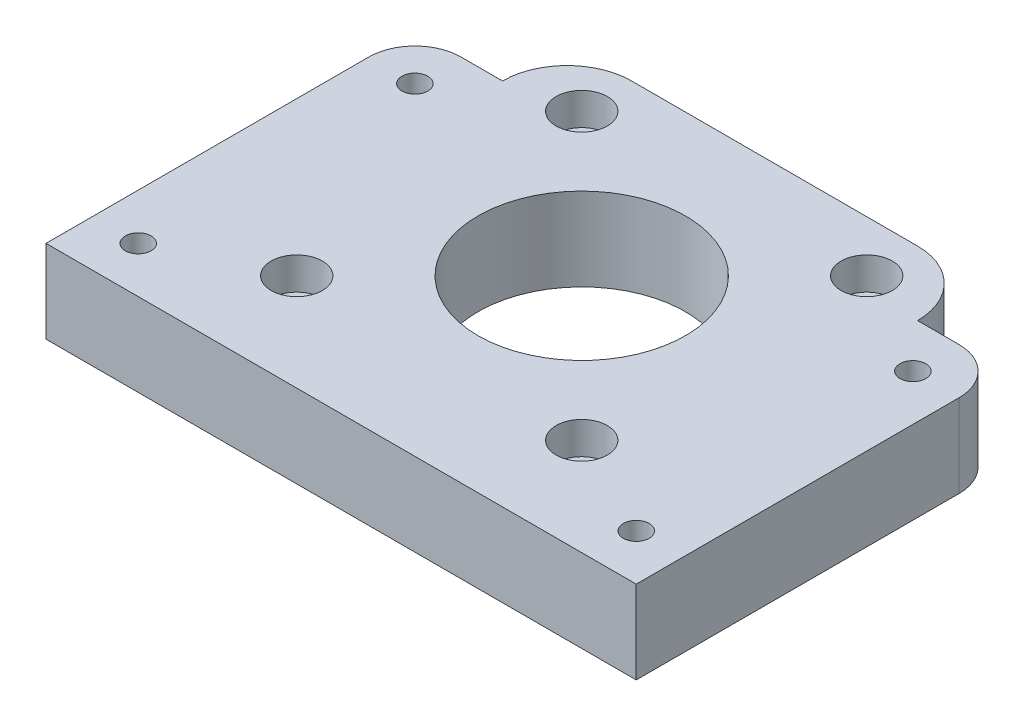
ISO-10303-21;
HEADER;
FILE_DESCRIPTION(('STEP AP214'),'2;1');
FILE_NAME('part.step','',(''),(''),'','','');
FILE_SCHEMA(('AUTOMOTIVE_DESIGN { 1 0 10303 214 1 1 1 1 }'));
ENDSEC;
DATA;
#1=APPLICATION_CONTEXT('core data for automotive mechanical design processes');
#2=APPLICATION_PROTOCOL_DEFINITION('international standard','automotive_design',2000,#1);
#3=PRODUCT_CONTEXT('',#1,'mechanical');
#4=PRODUCT('Part','Part','',(#3));
#5=PRODUCT_RELATED_PRODUCT_CATEGORY('part','',(#4));
#6=PRODUCT_DEFINITION_FORMATION('','',#4);
#7=PRODUCT_DEFINITION_CONTEXT('part definition',#1,'design');
#8=PRODUCT_DEFINITION('design','',#6,#7);
#9=PRODUCT_DEFINITION_SHAPE('','',#8);
#10=(LENGTH_UNIT() NAMED_UNIT(*) SI_UNIT(.MILLI.,.METRE.));
#11=(NAMED_UNIT(*) PLANE_ANGLE_UNIT() SI_UNIT($,.RADIAN.));
#12=(NAMED_UNIT(*) SI_UNIT($,.STERADIAN.) SOLID_ANGLE_UNIT());
#13=UNCERTAINTY_MEASURE_WITH_UNIT(LENGTH_MEASURE(1.E-05),#10,'distance_accuracy_value','');
#14=(GEOMETRIC_REPRESENTATION_CONTEXT(3) GLOBAL_UNCERTAINTY_ASSIGNED_CONTEXT((#13)) GLOBAL_UNIT_ASSIGNED_CONTEXT((#10,
#11,#12)) REPRESENTATION_CONTEXT('',''));
#15=CARTESIAN_POINT('',(0.,0.,0.));
#16=DIRECTION('',(0.,0.,1.));
#17=DIRECTION('',(1.,0.,0.));
#18=AXIS2_PLACEMENT_3D('',#15,#16,#17);
#19=CARTESIAN_POINT('',(-32.,9.,17.5));
#20=DIRECTION('',(0.,0.,-1.));
#21=DIRECTION('',(-1.,0.,0.));
#22=AXIS2_PLACEMENT_3D('',#19,#20,#21);
#23=PLANE('',#22);
#24=DIRECTION('',(1.,0.,0.));
#25=VECTOR('',#24,1.);
#26=CARTESIAN_POINT('',(-32.,0.,17.5));
#27=LINE('',#26,#25);
#28=CARTESIAN_POINT('',(-32.,0.,17.5));
#29=VERTEX_POINT('',#28);
#30=CARTESIAN_POINT('',(32.,0.,17.5));
#31=VERTEX_POINT('',#30);
#32=EDGE_CURVE('E153',#29,#31,#27,.T.);
#33=ORIENTED_EDGE('',*,*,#32,.T.);
#34=DIRECTION('',(0.,-1.,0.));
#35=VECTOR('',#34,1.);
#36=CARTESIAN_POINT('',(32.,9.,17.5));
#37=LINE('',#36,#35);
#38=CARTESIAN_POINT('',(32.,9.,17.5));
#39=VERTEX_POINT('',#38);
#40=EDGE_CURVE('E11',#39,#31,#37,.T.);
#41=ORIENTED_EDGE('',*,*,#40,.F.);
#42=DIRECTION('',(1.,0.,0.));
#43=VECTOR('',#42,1.);
#44=CARTESIAN_POINT('',(-32.,9.,17.5));
#45=LINE('',#44,#43);
#46=CARTESIAN_POINT('',(-32.,9.,17.5));
#47=VERTEX_POINT('',#46);
#48=EDGE_CURVE('E182',#47,#39,#45,.T.);
#49=ORIENTED_EDGE('',*,*,#48,.F.);
#50=DIRECTION('',(0.,-1.,0.));
#51=VECTOR('',#50,1.);
#52=CARTESIAN_POINT('',(-32.,9.,17.5));
#53=LINE('',#52,#51);
#54=EDGE_CURVE('E149',#47,#29,#53,.T.);
#55=ORIENTED_EDGE('',*,*,#54,.T.);
#56=EDGE_LOOP('',(#33,#41,#49,#55));
#57=FACE_BOUND('',#56,.T.);
#58=ADVANCED_FACE('F38',(#57),#23,.F.);
#59=CARTESIAN_POINT('',(32.,9.,17.5));
#60=DIRECTION('',(-1.,0.,0.));
#61=DIRECTION('',(0.,0.,1.));
#62=AXIS2_PLACEMENT_3D('',#59,#60,#61);
#63=PLANE('',#62);
#64=DIRECTION('',(0.,0.,-1.));
#65=VECTOR('',#64,1.);
#66=CARTESIAN_POINT('',(32.,0.,17.5));
#67=LINE('',#66,#65);
#68=CARTESIAN_POINT('',(32.,0.,-17.5));
#69=VERTEX_POINT('',#68);
#70=EDGE_CURVE('E157',#31,#69,#67,.T.);
#71=ORIENTED_EDGE('',*,*,#70,.T.);
#72=DIRECTION('',(0.,-1.,0.));
#73=VECTOR('',#72,1.);
#74=CARTESIAN_POINT('',(32.,9.,-17.5));
#75=LINE('',#74,#73);
#76=CARTESIAN_POINT('',(32.,9.,-17.5));
#77=VERTEX_POINT('',#76);
#78=EDGE_CURVE('E48',#77,#69,#75,.T.);
#79=ORIENTED_EDGE('',*,*,#78,.F.);
#80=DIRECTION('',(0.,0.,-1.));
#81=VECTOR('',#80,1.);
#82=CARTESIAN_POINT('',(32.,9.,17.5));
#83=LINE('',#82,#81);
#84=EDGE_CURVE('E106',#39,#77,#83,.T.);
#85=ORIENTED_EDGE('',*,*,#84,.F.);
#86=ORIENTED_EDGE('',*,*,#40,.T.);
#87=EDGE_LOOP('',(#71,#79,#85,#86));
#88=FACE_BOUND('',#87,.T.);
#89=ADVANCED_FACE('F409',(#88),#63,.F.);
#90=CARTESIAN_POINT('',(27.,9.,-17.5));
#91=DIRECTION('',(0.,-1.,0.));
#92=DIRECTION('',(0.,0.,-1.));
#93=AXIS2_PLACEMENT_3D('',#90,#91,#92);
#94=CYLINDRICAL_SURFACE('',#93,5.00000000000003);
#95=CARTESIAN_POINT('',(27.,0.,-17.5));
#96=DIRECTION('',(0.,1.,0.));
#97=DIRECTION('',(0.,0.,1.));
#98=AXIS2_PLACEMENT_3D('',#95,#96,#97);
#99=CIRCLE('',#98,5.00000000000003);
#100=CARTESIAN_POINT('',(27.,0.,-22.5));
#101=VERTEX_POINT('',#100);
#102=EDGE_CURVE('E161',#69,#101,#99,.T.);
#103=ORIENTED_EDGE('',*,*,#102,.T.);
#104=DIRECTION('',(0.,-1.,0.));
#105=VECTOR('',#104,1.);
#106=CARTESIAN_POINT('',(27.,9.,-22.5));
#107=LINE('',#106,#105);
#108=CARTESIAN_POINT('',(27.,9.,-22.5));
#109=VERTEX_POINT('',#108);
#110=EDGE_CURVE('E201',#109,#101,#107,.T.);
#111=ORIENTED_EDGE('',*,*,#110,.F.);
#112=CARTESIAN_POINT('',(27.,9.,-17.5));
#113=DIRECTION('',(0.,1.,0.));
#114=DIRECTION('',(0.,0.,1.));
#115=AXIS2_PLACEMENT_3D('',#112,#113,#114);
#116=CIRCLE('',#115,5.00000000000003);
#117=EDGE_CURVE('E333',#77,#109,#116,.T.);
#118=ORIENTED_EDGE('',*,*,#117,.F.);
#119=ORIENTED_EDGE('',*,*,#78,.T.);
#120=EDGE_LOOP('',(#103,#111,#118,#119));
#121=FACE_BOUND('',#120,.T.);
#122=ADVANCED_FACE('F413',(#121),#94,.T.);
#123=CARTESIAN_POINT('',(27.,9.,-22.5));
#124=DIRECTION('',(0.,0.,1.));
#125=DIRECTION('',(1.,0.,0.));
#126=AXIS2_PLACEMENT_3D('',#123,#124,#125);
#127=PLANE('',#126);
#128=DIRECTION('',(-1.,0.,0.));
#129=VECTOR('',#128,1.);
#130=CARTESIAN_POINT('',(27.,0.,-22.5));
#131=LINE('',#130,#129);
#132=CARTESIAN_POINT('',(22.5,0.,-22.5));
#133=VERTEX_POINT('',#132);
#134=EDGE_CURVE('E164',#101,#133,#131,.T.);
#135=ORIENTED_EDGE('',*,*,#134,.T.);
#136=DIRECTION('',(0.,-1.,0.));
#137=VECTOR('',#136,1.);
#138=CARTESIAN_POINT('',(22.5,9.,-22.5));
#139=LINE('',#138,#137);
#140=CARTESIAN_POINT('',(22.5,9.,-22.5));
#141=VERTEX_POINT('',#140);
#142=EDGE_CURVE('E197',#141,#133,#139,.T.);
#143=ORIENTED_EDGE('',*,*,#142,.F.);
#144=DIRECTION('',(-1.,0.,0.));
#145=VECTOR('',#144,1.);
#146=CARTESIAN_POINT('',(27.,9.,-22.5));
#147=LINE('',#146,#145);
#148=EDGE_CURVE('E336',#109,#141,#147,.T.);
#149=ORIENTED_EDGE('',*,*,#148,.F.);
#150=ORIENTED_EDGE('',*,*,#110,.T.);
#151=EDGE_LOOP('',(#135,#143,#149,#150));
#152=FACE_BOUND('',#151,.T.);
#153=ADVANCED_FACE('F417',(#152),#127,.F.);
#154=CARTESIAN_POINT('',(15.5,9.,-22.5));
#155=DIRECTION('',(0.,-1.,0.));
#156=DIRECTION('',(0.,0.,-1.));
#157=AXIS2_PLACEMENT_3D('',#154,#155,#156);
#158=CYLINDRICAL_SURFACE('',#157,6.99999999999999);
#159=CARTESIAN_POINT('',(15.5,0.,-22.5));
#160=DIRECTION('',(0.,1.,0.));
#161=DIRECTION('',(0.,0.,-1.));
#162=AXIS2_PLACEMENT_3D('',#159,#160,#161);
#163=CIRCLE('',#162,6.99999999999999);
#164=CARTESIAN_POINT('',(15.5,0.,-29.5));
#165=VERTEX_POINT('',#164);
#166=EDGE_CURVE('E167',#133,#165,#163,.T.);
#167=ORIENTED_EDGE('',*,*,#166,.T.);
#168=DIRECTION('',(0.,-1.,0.));
#169=VECTOR('',#168,1.);
#170=CARTESIAN_POINT('',(15.5,9.,-29.5));
#171=LINE('',#170,#169);
#172=CARTESIAN_POINT('',(15.5,9.,-29.5));
#173=VERTEX_POINT('',#172);
#174=EDGE_CURVE('E193',#173,#165,#171,.T.);
#175=ORIENTED_EDGE('',*,*,#174,.F.);
#176=CARTESIAN_POINT('',(15.5,9.,-22.5));
#177=DIRECTION('',(0.,1.,0.));
#178=DIRECTION('',(0.,0.,-1.));
#179=AXIS2_PLACEMENT_3D('',#176,#177,#178);
#180=CIRCLE('',#179,6.99999999999999);
#181=EDGE_CURVE('E339',#141,#173,#180,.T.);
#182=ORIENTED_EDGE('',*,*,#181,.F.);
#183=ORIENTED_EDGE('',*,*,#142,.T.);
#184=EDGE_LOOP('',(#167,#175,#182,#183));
#185=FACE_BOUND('',#184,.T.);
#186=ADVANCED_FACE('F423',(#185),#158,.T.);
#187=CARTESIAN_POINT('',(-15.5,9.,-29.5));
#188=DIRECTION('',(0.,0.,1.));
#189=DIRECTION('',(1.,0.,0.));
#190=AXIS2_PLACEMENT_3D('',#187,#188,#189);
#191=PLANE('',#190);
#192=DIRECTION('',(-1.,0.,0.));
#193=VECTOR('',#192,1.);
#194=CARTESIAN_POINT('',(-15.5,0.,-29.5));
#195=LINE('',#194,#193);
#196=CARTESIAN_POINT('',(-15.5,0.,-29.5));
#197=VERTEX_POINT('',#196);
#198=EDGE_CURVE('E170',#165,#197,#195,.T.);
#199=ORIENTED_EDGE('',*,*,#198,.T.);
#200=DIRECTION('',(0.,-1.,0.));
#201=VECTOR('',#200,1.);
#202=CARTESIAN_POINT('',(-15.5,9.,-29.5));
#203=LINE('',#202,#201);
#204=CARTESIAN_POINT('',(-15.5,9.,-29.5));
#205=VERTEX_POINT('',#204);
#206=EDGE_CURVE('E189',#205,#197,#203,.T.);
#207=ORIENTED_EDGE('',*,*,#206,.F.);
#208=DIRECTION('',(-1.,0.,0.));
#209=VECTOR('',#208,1.);
#210=CARTESIAN_POINT('',(-15.5,9.,-29.5));
#211=LINE('',#210,#209);
#212=EDGE_CURVE('E342',#173,#205,#211,.T.);
#213=ORIENTED_EDGE('',*,*,#212,.F.);
#214=ORIENTED_EDGE('',*,*,#174,.T.);
#215=EDGE_LOOP('',(#199,#207,#213,#214));
#216=FACE_BOUND('',#215,.T.);
#217=ADVANCED_FACE('F427',(#216),#191,.F.);
#218=CARTESIAN_POINT('',(-15.5,9.,-22.5));
#219=DIRECTION('',(0.,-1.,0.));
#220=DIRECTION('',(0.,0.,-1.));
#221=AXIS2_PLACEMENT_3D('',#218,#219,#220);
#222=CYLINDRICAL_SURFACE('',#221,6.99999999999999);
#223=CARTESIAN_POINT('',(-15.5,0.,-22.5));
#224=DIRECTION('',(0.,1.,0.));
#225=DIRECTION('',(0.,0.,1.));
#226=AXIS2_PLACEMENT_3D('',#223,#224,#225);
#227=CIRCLE('',#226,6.99999999999999);
#228=CARTESIAN_POINT('',(-22.5,0.,-22.5));
#229=VERTEX_POINT('',#228);
#230=EDGE_CURVE('E173',#197,#229,#227,.T.);
#231=ORIENTED_EDGE('',*,*,#230,.T.);
#232=DIRECTION('',(0.,-1.,0.));
#233=VECTOR('',#232,1.);
#234=CARTESIAN_POINT('',(-22.5,9.,-22.5));
#235=LINE('',#234,#233);
#236=CARTESIAN_POINT('',(-22.5,9.,-22.5));
#237=VERTEX_POINT('',#236);
#238=EDGE_CURVE('E142',#237,#229,#235,.T.);
#239=ORIENTED_EDGE('',*,*,#238,.F.);
#240=CARTESIAN_POINT('',(-15.5,9.,-22.5));
#241=DIRECTION('',(0.,1.,0.));
#242=DIRECTION('',(0.,0.,1.));
#243=AXIS2_PLACEMENT_3D('',#240,#241,#242);
#244=CIRCLE('',#243,6.99999999999999);
#245=EDGE_CURVE('E131',#205,#237,#244,.T.);
#246=ORIENTED_EDGE('',*,*,#245,.F.);
#247=ORIENTED_EDGE('',*,*,#206,.T.);
#248=EDGE_LOOP('',(#231,#239,#246,#247));
#249=FACE_BOUND('',#248,.T.);
#250=ADVANCED_FACE('F431',(#249),#222,.T.);
#251=CARTESIAN_POINT('',(-27.,9.,-22.5));
#252=DIRECTION('',(0.,0.,1.));
#253=DIRECTION('',(1.,0.,0.));
#254=AXIS2_PLACEMENT_3D('',#251,#252,#253);
#255=PLANE('',#254);
#256=DIRECTION('',(-1.,0.,0.));
#257=VECTOR('',#256,1.);
#258=CARTESIAN_POINT('',(-27.,0.,-22.5));
#259=LINE('',#258,#257);
#260=CARTESIAN_POINT('',(-27.,0.,-22.5));
#261=VERTEX_POINT('',#260);
#262=EDGE_CURVE('E140',#229,#261,#259,.T.);
#263=ORIENTED_EDGE('',*,*,#262,.T.);
#264=DIRECTION('',(0.,-1.,0.));
#265=VECTOR('',#264,1.);
#266=CARTESIAN_POINT('',(-27.,9.,-22.5));
#267=LINE('',#266,#265);
#268=CARTESIAN_POINT('',(-27.,9.,-22.5));
#269=VERTEX_POINT('',#268);
#270=EDGE_CURVE('E137',#269,#261,#267,.T.);
#271=ORIENTED_EDGE('',*,*,#270,.F.);
#272=DIRECTION('',(-1.,0.,0.));
#273=VECTOR('',#272,1.);
#274=CARTESIAN_POINT('',(-27.,9.,-22.5));
#275=LINE('',#274,#273);
#276=EDGE_CURVE('E125',#237,#269,#275,.T.);
#277=ORIENTED_EDGE('',*,*,#276,.F.);
#278=ORIENTED_EDGE('',*,*,#238,.T.);
#279=EDGE_LOOP('',(#263,#271,#277,#278));
#280=FACE_BOUND('',#279,.T.);
#281=ADVANCED_FACE('F138',(#280),#255,.F.);
#282=CARTESIAN_POINT('',(-27.,9.,-17.5));
#283=DIRECTION('',(0.,-1.,0.));
#284=DIRECTION('',(0.,0.,-1.));
#285=AXIS2_PLACEMENT_3D('',#282,#283,#284);
#286=CYLINDRICAL_SURFACE('',#285,5.00000000000002);
#287=CARTESIAN_POINT('',(-27.,0.,-17.5));
#288=DIRECTION('',(0.,1.,0.));
#289=DIRECTION('',(0.,0.,-1.));
#290=AXIS2_PLACEMENT_3D('',#287,#288,#289);
#291=CIRCLE('',#290,5.00000000000002);
#292=CARTESIAN_POINT('',(-32.,0.,-17.5));
#293=VERTEX_POINT('',#292);
#294=EDGE_CURVE('E92',#261,#293,#291,.T.);
#295=ORIENTED_EDGE('',*,*,#294,.T.);
#296=DIRECTION('',(0.,-1.,0.));
#297=VECTOR('',#296,1.);
#298=CARTESIAN_POINT('',(-32.,9.,-17.5));
#299=LINE('',#298,#297);
#300=CARTESIAN_POINT('',(-32.,9.,-17.5));
#301=VERTEX_POINT('',#300);
#302=EDGE_CURVE('E143',#301,#293,#299,.T.);
#303=ORIENTED_EDGE('',*,*,#302,.F.);
#304=CARTESIAN_POINT('',(-27.,9.,-17.5));
#305=DIRECTION('',(0.,1.,0.));
#306=DIRECTION('',(0.,0.,-1.));
#307=AXIS2_PLACEMENT_3D('',#304,#305,#306);
#308=CIRCLE('',#307,5.00000000000002);
#309=EDGE_CURVE('E129',#269,#301,#308,.T.);
#310=ORIENTED_EDGE('',*,*,#309,.F.);
#311=ORIENTED_EDGE('',*,*,#270,.T.);
#312=EDGE_LOOP('',(#295,#303,#310,#311));
#313=FACE_BOUND('',#312,.T.);
#314=ADVANCED_FACE('F145',(#313),#286,.T.);
#315=CARTESIAN_POINT('',(-32.,9.,17.5));
#316=DIRECTION('',(1.,0.,0.));
#317=DIRECTION('',(0.,0.,-1.));
#318=AXIS2_PLACEMENT_3D('',#315,#316,#317);
#319=PLANE('',#318);
#320=DIRECTION('',(0.,0.,1.));
#321=VECTOR('',#320,1.);
#322=CARTESIAN_POINT('',(-32.,0.,17.5));
#323=LINE('',#322,#321);
#324=EDGE_CURVE('E98',#293,#29,#323,.T.);
#325=ORIENTED_EDGE('',*,*,#324,.T.);
#326=ORIENTED_EDGE('',*,*,#54,.F.);
#327=DIRECTION('',(0.,0.,1.));
#328=VECTOR('',#327,1.);
#329=CARTESIAN_POINT('',(-32.,9.,17.5));
#330=LINE('',#329,#328);
#331=EDGE_CURVE('E57',#301,#47,#330,.T.);
#332=ORIENTED_EDGE('',*,*,#331,.F.);
#333=ORIENTED_EDGE('',*,*,#302,.T.);
#334=EDGE_LOOP('',(#325,#326,#332,#333));
#335=FACE_BOUND('',#334,.T.);
#336=ADVANCED_FACE('F397',(#335),#319,.F.);
#337=CARTESIAN_POINT('',(27.,9.,-17.5));
#338=DIRECTION('',(0.,1.,0.));
#339=DIRECTION('',(0.,0.,1.));
#340=AXIS2_PLACEMENT_3D('',#337,#338,#339);
#341=PLANE('',#340);
#342=CARTESIAN_POINT('',(-27.,9.,12.5));
#343=DIRECTION('',(0.,1.,0.));
#344=DIRECTION('',(0.,0.,1.));
#345=AXIS2_PLACEMENT_3D('',#342,#343,#344);
#346=CIRCLE('',#345,1.4);
#347=CARTESIAN_POINT('',(-27.,9.,13.9));
#348=VERTEX_POINT('',#347);
#349=EDGE_CURVE('E41',#348,#348,#346,.T.);
#350=ORIENTED_EDGE('',*,*,#349,.F.);
#351=EDGE_LOOP('',(#350));
#352=FACE_BOUND('',#351,.T.);
#353=CARTESIAN_POINT('',(-27.,9.,-17.5));
#354=DIRECTION('',(0.,1.,0.));
#355=DIRECTION('',(0.,0.,1.));
#356=AXIS2_PLACEMENT_3D('',#353,#354,#355);
#357=CIRCLE('',#356,1.4);
#358=CARTESIAN_POINT('',(-27.,9.,-16.1));
#359=VERTEX_POINT('',#358);
#360=EDGE_CURVE('E234',#359,#359,#357,.T.);
#361=ORIENTED_EDGE('',*,*,#360,.F.);
#362=EDGE_LOOP('',(#361));
#363=FACE_BOUND('',#362,.T.);
#364=CARTESIAN_POINT('',(27.,9.,-17.5));
#365=DIRECTION('',(0.,1.,0.));
#366=DIRECTION('',(0.,0.,1.));
#367=AXIS2_PLACEMENT_3D('',#364,#365,#366);
#368=CIRCLE('',#367,1.4);
#369=CARTESIAN_POINT('',(27.,9.,-16.1));
#370=VERTEX_POINT('',#369);
#371=EDGE_CURVE('E230',#370,#370,#368,.T.);
#372=ORIENTED_EDGE('',*,*,#371,.F.);
#373=EDGE_LOOP('',(#372));
#374=FACE_BOUND('',#373,.T.);
#375=CARTESIAN_POINT('',(27.,9.,12.5));
#376=DIRECTION('',(0.,1.,0.));
#377=DIRECTION('',(0.,0.,1.));
#378=AXIS2_PLACEMENT_3D('',#375,#376,#377);
#379=CIRCLE('',#378,1.4);
#380=CARTESIAN_POINT('',(27.,9.,13.9));
#381=VERTEX_POINT('',#380);
#382=EDGE_CURVE('E226',#381,#381,#379,.T.);
#383=ORIENTED_EDGE('',*,*,#382,.F.);
#384=EDGE_LOOP('',(#383));
#385=FACE_BOUND('',#384,.T.);
#386=CARTESIAN_POINT('',(-15.3602831689261,9.,6.95028316892605));
#387=DIRECTION('',(0.,1.,0.));
#388=DIRECTION('',(0.,0.,1.));
#389=AXIS2_PLACEMENT_3D('',#386,#387,#388);
#390=CIRCLE('',#389,2.775);
#391=CARTESIAN_POINT('',(-15.3602831689261,9.,9.72528316892605));
#392=VERTEX_POINT('',#391);
#393=EDGE_CURVE('E287',#392,#392,#390,.T.);
#394=ORIENTED_EDGE('',*,*,#393,.F.);
#395=EDGE_LOOP('',(#394));
#396=FACE_BOUND('',#395,.T.);
#397=CARTESIAN_POINT('',(15.5402831689261,9.,6.95028316892605));
#398=DIRECTION('',(0.,1.,0.));
#399=DIRECTION('',(0.,0.,1.));
#400=AXIS2_PLACEMENT_3D('',#397,#398,#399);
#401=CIRCLE('',#400,2.775);
#402=CARTESIAN_POINT('',(15.5402831689261,9.,9.72528316892605));
#403=VERTEX_POINT('',#402);
#404=EDGE_CURVE('E304',#403,#403,#401,.T.);
#405=ORIENTED_EDGE('',*,*,#404,.F.);
#406=EDGE_LOOP('',(#405));
#407=FACE_BOUND('',#406,.T.);
#408=CARTESIAN_POINT('',(15.5402831689261,9.,-23.9502831689261));
#409=DIRECTION('',(0.,1.,0.));
#410=DIRECTION('',(0.,0.,1.));
#411=AXIS2_PLACEMENT_3D('',#408,#409,#410);
#412=CIRCLE('',#411,2.775);
#413=CARTESIAN_POINT('',(15.5402831689261,9.,-21.1752831689261));
#414=VERTEX_POINT('',#413);
#415=EDGE_CURVE('E296',#414,#414,#412,.T.);
#416=ORIENTED_EDGE('',*,*,#415,.F.);
#417=EDGE_LOOP('',(#416));
#418=FACE_BOUND('',#417,.T.);
#419=CARTESIAN_POINT('',(-15.3602831689261,9.,-23.9502831689261));
#420=DIRECTION('',(0.,1.,0.));
#421=DIRECTION('',(0.,0.,1.));
#422=AXIS2_PLACEMENT_3D('',#419,#420,#421);
#423=CIRCLE('',#422,2.775);
#424=CARTESIAN_POINT('',(-15.3602831689261,9.,-21.1752831689261));
#425=VERTEX_POINT('',#424);
#426=EDGE_CURVE('E295',#425,#425,#423,.T.);
#427=ORIENTED_EDGE('',*,*,#426,.F.);
#428=EDGE_LOOP('',(#427));
#429=FACE_BOUND('',#428,.T.);
#430=CARTESIAN_POINT('',(0.0900000000000067,9.,-8.50000000000001));
#431=DIRECTION('',(0.,1.,0.));
#432=DIRECTION('',(0.,0.,1.));
#433=AXIS2_PLACEMENT_3D('',#430,#431,#432);
#434=CIRCLE('',#433,11.25);
#435=CARTESIAN_POINT('',(0.0900000000000067,9.,2.74999999999999));
#436=VERTEX_POINT('',#435);
#437=EDGE_CURVE('E319',#436,#436,#434,.T.);
#438=ORIENTED_EDGE('',*,*,#437,.F.);
#439=EDGE_LOOP('',(#438));
#440=FACE_BOUND('',#439,.T.);
#441=ORIENTED_EDGE('',*,*,#48,.T.);
#442=ORIENTED_EDGE('',*,*,#84,.T.);
#443=ORIENTED_EDGE('',*,*,#117,.T.);
#444=ORIENTED_EDGE('',*,*,#148,.T.);
#445=ORIENTED_EDGE('',*,*,#181,.T.);
#446=ORIENTED_EDGE('',*,*,#212,.T.);
#447=ORIENTED_EDGE('',*,*,#245,.T.);
#448=ORIENTED_EDGE('',*,*,#276,.T.);
#449=ORIENTED_EDGE('',*,*,#309,.T.);
#450=ORIENTED_EDGE('',*,*,#331,.T.);
#451=EDGE_LOOP('',(#441,#442,#443,#444,#445,#446,#447,#448,#449,#450));
#452=FACE_BOUND('',#451,.T.);
#453=ADVANCED_FACE('F127',(#352,#363,#374,#385,#396,#407,#418,#429,#440,#452),#341,.T.);
#454=CARTESIAN_POINT('',(27.,0.,-17.5));
#455=DIRECTION('',(0.,1.,0.));
#456=DIRECTION('',(0.,0.,1.));
#457=AXIS2_PLACEMENT_3D('',#454,#455,#456);
#458=PLANE('',#457);
#459=CARTESIAN_POINT('',(-15.3602831689261,0.,6.95028316892605));
#460=DIRECTION('',(0.,1.,0.));
#461=DIRECTION('',(0.,0.,1.));
#462=AXIS2_PLACEMENT_3D('',#459,#460,#461);
#463=CIRCLE('',#462,1.5);
#464=CARTESIAN_POINT('',(-15.3602831689261,0.,8.45028316892605));
#465=VERTEX_POINT('',#464);
#466=EDGE_CURVE('E221',#465,#465,#463,.T.);
#467=ORIENTED_EDGE('',*,*,#466,.T.);
#468=EDGE_LOOP('',(#467));
#469=FACE_BOUND('',#468,.T.);
#470=CARTESIAN_POINT('',(15.5402831689261,0.,6.95028316892605));
#471=DIRECTION('',(0.,1.,0.));
#472=DIRECTION('',(0.,0.,1.));
#473=AXIS2_PLACEMENT_3D('',#470,#471,#472);
#474=CIRCLE('',#473,1.5);
#475=CARTESIAN_POINT('',(15.5402831689261,0.,8.45028316892605));
#476=VERTEX_POINT('',#475);
#477=EDGE_CURVE('E217',#476,#476,#474,.T.);
#478=ORIENTED_EDGE('',*,*,#477,.T.);
#479=EDGE_LOOP('',(#478));
#480=FACE_BOUND('',#479,.T.);
#481=CARTESIAN_POINT('',(15.5402831689261,0.,-23.9502831689261));
#482=DIRECTION('',(0.,1.,0.));
#483=DIRECTION('',(0.,0.,1.));
#484=AXIS2_PLACEMENT_3D('',#481,#482,#483);
#485=CIRCLE('',#484,1.5);
#486=CARTESIAN_POINT('',(15.5402831689261,0.,-22.4502831689261));
#487=VERTEX_POINT('',#486);
#488=EDGE_CURVE('E212',#487,#487,#485,.T.);
#489=ORIENTED_EDGE('',*,*,#488,.T.);
#490=EDGE_LOOP('',(#489));
#491=FACE_BOUND('',#490,.T.);
#492=CARTESIAN_POINT('',(-15.3602831689261,0.,-23.9502831689261));
#493=DIRECTION('',(0.,1.,0.));
#494=DIRECTION('',(0.,0.,1.));
#495=AXIS2_PLACEMENT_3D('',#492,#493,#494);
#496=CIRCLE('',#495,1.5);
#497=CARTESIAN_POINT('',(-15.3602831689261,0.,-22.4502831689261));
#498=VERTEX_POINT('',#497);
#499=EDGE_CURVE('E208',#498,#498,#496,.T.);
#500=ORIENTED_EDGE('',*,*,#499,.T.);
#501=EDGE_LOOP('',(#500));
#502=FACE_BOUND('',#501,.T.);
#503=CARTESIAN_POINT('',(-27.,0.,12.5));
#504=DIRECTION('',(0.,1.,0.));
#505=DIRECTION('',(0.,0.,1.));
#506=AXIS2_PLACEMENT_3D('',#503,#504,#505);
#507=CIRCLE('',#506,2.775);
#508=CARTESIAN_POINT('',(-27.,0.,15.275));
#509=VERTEX_POINT('',#508);
#510=EDGE_CURVE('E225',#509,#509,#507,.T.);
#511=ORIENTED_EDGE('',*,*,#510,.T.);
#512=EDGE_LOOP('',(#511));
#513=FACE_BOUND('',#512,.T.);
#514=CARTESIAN_POINT('',(27.,0.,12.5));
#515=DIRECTION('',(0.,1.,0.));
#516=DIRECTION('',(0.,0.,1.));
#517=AXIS2_PLACEMENT_3D('',#514,#515,#516);
#518=CIRCLE('',#517,2.775);
#519=CARTESIAN_POINT('',(27.,0.,15.275));
#520=VERTEX_POINT('',#519);
#521=EDGE_CURVE('E272',#520,#520,#518,.T.);
#522=ORIENTED_EDGE('',*,*,#521,.T.);
#523=EDGE_LOOP('',(#522));
#524=FACE_BOUND('',#523,.T.);
#525=CARTESIAN_POINT('',(27.,0.,-17.5));
#526=DIRECTION('',(0.,1.,0.));
#527=DIRECTION('',(0.,0.,1.));
#528=AXIS2_PLACEMENT_3D('',#525,#526,#527);
#529=CIRCLE('',#528,2.775);
#530=CARTESIAN_POINT('',(27.,0.,-14.725));
#531=VERTEX_POINT('',#530);
#532=EDGE_CURVE('E264',#531,#531,#529,.T.);
#533=ORIENTED_EDGE('',*,*,#532,.T.);
#534=EDGE_LOOP('',(#533));
#535=FACE_BOUND('',#534,.T.);
#536=CARTESIAN_POINT('',(-27.,0.,-17.5));
#537=DIRECTION('',(0.,1.,0.));
#538=DIRECTION('',(0.,0.,1.));
#539=AXIS2_PLACEMENT_3D('',#536,#537,#538);
#540=CIRCLE('',#539,2.775);
#541=CARTESIAN_POINT('',(-27.,0.,-14.725));
#542=VERTEX_POINT('',#541);
#543=EDGE_CURVE('E263',#542,#542,#540,.T.);
#544=ORIENTED_EDGE('',*,*,#543,.T.);
#545=EDGE_LOOP('',(#544));
#546=FACE_BOUND('',#545,.T.);
#547=CARTESIAN_POINT('',(0.0900000000000067,0.,-8.50000000000001));
#548=DIRECTION('',(0.,1.,0.));
#549=DIRECTION('',(0.,0.,1.));
#550=AXIS2_PLACEMENT_3D('',#547,#548,#549);
#551=CIRCLE('',#550,11.25);
#552=CARTESIAN_POINT('',(0.0900000000000067,0.,2.74999999999999));
#553=VERTEX_POINT('',#552);
#554=EDGE_CURVE('E158',#553,#553,#551,.T.);
#555=ORIENTED_EDGE('',*,*,#554,.T.);
#556=EDGE_LOOP('',(#555));
#557=FACE_BOUND('',#556,.T.);
#558=ORIENTED_EDGE('',*,*,#32,.F.);
#559=ORIENTED_EDGE('',*,*,#324,.F.);
#560=ORIENTED_EDGE('',*,*,#294,.F.);
#561=ORIENTED_EDGE('',*,*,#262,.F.);
#562=ORIENTED_EDGE('',*,*,#230,.F.);
#563=ORIENTED_EDGE('',*,*,#198,.F.);
#564=ORIENTED_EDGE('',*,*,#166,.F.);
#565=ORIENTED_EDGE('',*,*,#134,.F.);
#566=ORIENTED_EDGE('',*,*,#102,.F.);
#567=ORIENTED_EDGE('',*,*,#70,.F.);
#568=EDGE_LOOP('',(#558,#559,#560,#561,#562,#563,#564,#565,#566,#567));
#569=FACE_BOUND('',#568,.T.);
#570=ADVANCED_FACE('F382',(#469,#480,#491,#502,#513,#524,#535,#546,#557,#569),#458,.F.);
#571=CARTESIAN_POINT('',(0.0900000000000067,0.,-8.50000000000001));
#572=DIRECTION('',(0.,1.,0.));
#573=DIRECTION('',(0.,0.,1.));
#574=AXIS2_PLACEMENT_3D('',#571,#572,#573);
#575=CYLINDRICAL_SURFACE('',#574,11.25);
#576=ORIENTED_EDGE('',*,*,#554,.F.);
#577=EDGE_LOOP('',(#576));
#578=FACE_BOUND('',#577,.T.);
#579=ORIENTED_EDGE('',*,*,#437,.T.);
#580=EDGE_LOOP('',(#579));
#581=FACE_BOUND('',#580,.T.);
#582=ADVANCED_FACE('F385',(#578,#581),#575,.F.);
#583=CARTESIAN_POINT('',(-15.3602831689261,5.5,-23.9502831689261));
#584=DIRECTION('',(0.,1.,0.));
#585=DIRECTION('',(0.,0.,1.));
#586=AXIS2_PLACEMENT_3D('',#583,#584,#585);
#587=CYLINDRICAL_SURFACE('',#586,2.775);
#588=CARTESIAN_POINT('',(-15.3602831689261,5.5,-23.9502831689261));
#589=DIRECTION('',(0.,1.,0.));
#590=DIRECTION('',(0.,0.,1.));
#591=AXIS2_PLACEMENT_3D('',#588,#589,#590);
#592=CIRCLE('',#591,2.775);
#593=CARTESIAN_POINT('',(-15.3602831689261,5.5,-21.1752831689261));
#594=VERTEX_POINT('',#593);
#595=EDGE_CURVE('E315',#594,#594,#592,.T.);
#596=ORIENTED_EDGE('',*,*,#595,.F.);
#597=EDGE_LOOP('',(#596));
#598=FACE_BOUND('',#597,.T.);
#599=ORIENTED_EDGE('',*,*,#426,.T.);
#600=EDGE_LOOP('',(#599));
#601=FACE_BOUND('',#600,.T.);
#602=ADVANCED_FACE('F459',(#598,#601),#587,.F.);
#603=CARTESIAN_POINT('',(-15.3602831689261,5.5,-23.9502831689261));
#604=DIRECTION('',(0.,1.,0.));
#605=DIRECTION('',(0.,0.,1.));
#606=AXIS2_PLACEMENT_3D('',#603,#604,#605);
#607=PLANE('',#606);
#608=CARTESIAN_POINT('',(-15.3602831689261,5.5,-23.9502831689261));
#609=DIRECTION('',(0.,1.,0.));
#610=DIRECTION('',(0.,0.,1.));
#611=AXIS2_PLACEMENT_3D('',#608,#609,#610);
#612=CIRCLE('',#611,1.5);
#613=CARTESIAN_POINT('',(-15.3602831689261,5.5,-22.4502831689261));
#614=VERTEX_POINT('',#613);
#615=EDGE_CURVE('E213',#614,#614,#612,.T.);
#616=ORIENTED_EDGE('',*,*,#615,.F.);
#617=EDGE_LOOP('',(#616));
#618=FACE_BOUND('',#617,.T.);
#619=ORIENTED_EDGE('',*,*,#595,.T.);
#620=EDGE_LOOP('',(#619));
#621=FACE_BOUND('',#620,.T.);
#622=ADVANCED_FACE('F471',(#618,#621),#607,.T.);
#623=CARTESIAN_POINT('',(15.5402831689261,5.5,-23.9502831689261));
#624=DIRECTION('',(0.,1.,0.));
#625=DIRECTION('',(0.,0.,1.));
#626=AXIS2_PLACEMENT_3D('',#623,#624,#625);
#627=CYLINDRICAL_SURFACE('',#626,2.775);
#628=CARTESIAN_POINT('',(15.5402831689261,5.5,-23.9502831689261));
#629=DIRECTION('',(0.,1.,0.));
#630=DIRECTION('',(0.,0.,1.));
#631=AXIS2_PLACEMENT_3D('',#628,#629,#630);
#632=CIRCLE('',#631,2.775);
#633=CARTESIAN_POINT('',(15.5402831689261,5.5,-21.1752831689261));
#634=VERTEX_POINT('',#633);
#635=EDGE_CURVE('E291',#634,#634,#632,.T.);
#636=ORIENTED_EDGE('',*,*,#635,.F.);
#637=EDGE_LOOP('',(#636));
#638=FACE_BOUND('',#637,.T.);
#639=ORIENTED_EDGE('',*,*,#415,.T.);
#640=EDGE_LOOP('',(#639));
#641=FACE_BOUND('',#640,.T.);
#642=ADVANCED_FACE('F479',(#638,#641),#627,.F.);
#643=CARTESIAN_POINT('',(15.5402831689261,5.5,-23.9502831689261));
#644=DIRECTION('',(0.,1.,0.));
#645=DIRECTION('',(0.,0.,1.));
#646=AXIS2_PLACEMENT_3D('',#643,#644,#645);
#647=PLANE('',#646);
#648=CARTESIAN_POINT('',(15.5402831689261,5.5,-23.9502831689261));
#649=DIRECTION('',(0.,1.,0.));
#650=DIRECTION('',(0.,0.,1.));
#651=AXIS2_PLACEMENT_3D('',#648,#649,#650);
#652=CIRCLE('',#651,1.5);
#653=CARTESIAN_POINT('',(15.5402831689261,5.5,-22.4502831689261));
#654=VERTEX_POINT('',#653);
#655=EDGE_CURVE('E252',#654,#654,#652,.T.);
#656=ORIENTED_EDGE('',*,*,#655,.F.);
#657=EDGE_LOOP('',(#656));
#658=FACE_BOUND('',#657,.T.);
#659=ORIENTED_EDGE('',*,*,#635,.T.);
#660=EDGE_LOOP('',(#659));
#661=FACE_BOUND('',#660,.T.);
#662=ADVANCED_FACE('F484',(#658,#661),#647,.T.);
#663=CARTESIAN_POINT('',(15.5402831689261,5.5,6.95028316892605));
#664=DIRECTION('',(0.,1.,0.));
#665=DIRECTION('',(0.,0.,1.));
#666=AXIS2_PLACEMENT_3D('',#663,#664,#665);
#667=CYLINDRICAL_SURFACE('',#666,2.775);
#668=CARTESIAN_POINT('',(15.5402831689261,5.5,6.95028316892605));
#669=DIRECTION('',(0.,1.,0.));
#670=DIRECTION('',(0.,0.,1.));
#671=AXIS2_PLACEMENT_3D('',#668,#669,#670);
#672=CIRCLE('',#671,2.775);
#673=CARTESIAN_POINT('',(15.5402831689261,5.5,9.72528316892605));
#674=VERTEX_POINT('',#673);
#675=EDGE_CURVE('E300',#674,#674,#672,.T.);
#676=ORIENTED_EDGE('',*,*,#675,.F.);
#677=EDGE_LOOP('',(#676));
#678=FACE_BOUND('',#677,.T.);
#679=ORIENTED_EDGE('',*,*,#404,.T.);
#680=EDGE_LOOP('',(#679));
#681=FACE_BOUND('',#680,.T.);
#682=ADVANCED_FACE('F492',(#678,#681),#667,.F.);
#683=CARTESIAN_POINT('',(15.5402831689261,5.5,6.95028316892605));
#684=DIRECTION('',(0.,1.,0.));
#685=DIRECTION('',(0.,0.,1.));
#686=AXIS2_PLACEMENT_3D('',#683,#684,#685);
#687=PLANE('',#686);
#688=CARTESIAN_POINT('',(15.5402831689261,5.5,6.95028316892605));
#689=DIRECTION('',(0.,1.,0.));
#690=DIRECTION('',(0.,0.,1.));
#691=AXIS2_PLACEMENT_3D('',#688,#689,#690);
#692=CIRCLE('',#691,1.5);
#693=CARTESIAN_POINT('',(15.5402831689261,5.5,8.45028316892605));
#694=VERTEX_POINT('',#693);
#695=EDGE_CURVE('E246',#694,#694,#692,.T.);
#696=ORIENTED_EDGE('',*,*,#695,.F.);
#697=EDGE_LOOP('',(#696));
#698=FACE_BOUND('',#697,.T.);
#699=ORIENTED_EDGE('',*,*,#675,.T.);
#700=EDGE_LOOP('',(#699));
#701=FACE_BOUND('',#700,.T.);
#702=ADVANCED_FACE('F497',(#698,#701),#687,.T.);
#703=CARTESIAN_POINT('',(-15.3602831689261,5.5,6.95028316892605));
#704=DIRECTION('',(0.,1.,0.));
#705=DIRECTION('',(0.,0.,1.));
#706=AXIS2_PLACEMENT_3D('',#703,#704,#705);
#707=CYLINDRICAL_SURFACE('',#706,2.775);
#708=CARTESIAN_POINT('',(-15.3602831689261,5.5,6.95028316892605));
#709=DIRECTION('',(0.,1.,0.));
#710=DIRECTION('',(0.,0.,1.));
#711=AXIS2_PLACEMENT_3D('',#708,#709,#710);
#712=CIRCLE('',#711,2.775);
#713=CARTESIAN_POINT('',(-15.3602831689261,5.5,9.72528316892605));
#714=VERTEX_POINT('',#713);
#715=EDGE_CURVE('E308',#714,#714,#712,.T.);
#716=ORIENTED_EDGE('',*,*,#715,.F.);
#717=EDGE_LOOP('',(#716));
#718=FACE_BOUND('',#717,.T.);
#719=ORIENTED_EDGE('',*,*,#393,.T.);
#720=EDGE_LOOP('',(#719));
#721=FACE_BOUND('',#720,.T.);
#722=ADVANCED_FACE('F505',(#718,#721),#707,.F.);
#723=CARTESIAN_POINT('',(-15.3602831689261,5.5,6.95028316892605));
#724=DIRECTION('',(0.,1.,0.));
#725=DIRECTION('',(0.,0.,1.));
#726=AXIS2_PLACEMENT_3D('',#723,#724,#725);
#727=PLANE('',#726);
#728=CARTESIAN_POINT('',(-15.3602831689261,5.5,6.95028316892605));
#729=DIRECTION('',(0.,1.,0.));
#730=DIRECTION('',(0.,0.,1.));
#731=AXIS2_PLACEMENT_3D('',#728,#729,#730);
#732=CIRCLE('',#731,1.5);
#733=CARTESIAN_POINT('',(-15.3602831689261,5.5,8.45028316892605));
#734=VERTEX_POINT('',#733);
#735=EDGE_CURVE('E241',#734,#734,#732,.T.);
#736=ORIENTED_EDGE('',*,*,#735,.F.);
#737=EDGE_LOOP('',(#736));
#738=FACE_BOUND('',#737,.T.);
#739=ORIENTED_EDGE('',*,*,#715,.T.);
#740=EDGE_LOOP('',(#739));
#741=FACE_BOUND('',#740,.T.);
#742=ADVANCED_FACE('F510',(#738,#741),#727,.T.);
#743=CARTESIAN_POINT('',(-27.,3.5,-17.5));
#744=DIRECTION('',(0.,-1.,0.));
#745=DIRECTION('',(0.,0.,-1.));
#746=AXIS2_PLACEMENT_3D('',#743,#744,#745);
#747=CYLINDRICAL_SURFACE('',#746,2.775);
#748=CARTESIAN_POINT('',(-27.,3.5,-17.5));
#749=DIRECTION('',(0.,1.,0.));
#750=DIRECTION('',(0.,0.,1.));
#751=AXIS2_PLACEMENT_3D('',#748,#749,#750);
#752=CIRCLE('',#751,2.775);
#753=CARTESIAN_POINT('',(-27.,3.5,-14.725));
#754=VERTEX_POINT('',#753);
#755=EDGE_CURVE('E283',#754,#754,#752,.T.);
#756=ORIENTED_EDGE('',*,*,#755,.T.);
#757=EDGE_LOOP('',(#756));
#758=FACE_BOUND('',#757,.T.);
#759=ORIENTED_EDGE('',*,*,#543,.F.);
#760=EDGE_LOOP('',(#759));
#761=FACE_BOUND('',#760,.T.);
#762=ADVANCED_FACE('F518',(#758,#761),#747,.F.);
#763=CARTESIAN_POINT('',(-27.,3.5,-17.5));
#764=DIRECTION('',(0.,1.,0.));
#765=DIRECTION('',(0.,0.,1.));
#766=AXIS2_PLACEMENT_3D('',#763,#764,#765);
#767=PLANE('',#766);
#768=CARTESIAN_POINT('',(-27.,3.5,-17.5));
#769=DIRECTION('',(0.,-1.,0.));
#770=DIRECTION('',(0.,0.,-1.));
#771=AXIS2_PLACEMENT_3D('',#768,#769,#770);
#772=CIRCLE('',#771,1.4);
#773=CARTESIAN_POINT('',(-27.,3.5,-18.9));
#774=VERTEX_POINT('',#773);
#775=EDGE_CURVE('E358',#774,#774,#772,.T.);
#776=ORIENTED_EDGE('',*,*,#775,.F.);
#777=EDGE_LOOP('',(#776));
#778=FACE_BOUND('',#777,.T.);
#779=ORIENTED_EDGE('',*,*,#755,.F.);
#780=EDGE_LOOP('',(#779));
#781=FACE_BOUND('',#780,.T.);
#782=ADVANCED_FACE('F378',(#778,#781),#767,.F.);
#783=CARTESIAN_POINT('',(27.,3.5,-17.5));
#784=DIRECTION('',(0.,-1.,0.));
#785=DIRECTION('',(0.,0.,-1.));
#786=AXIS2_PLACEMENT_3D('',#783,#784,#785);
#787=CYLINDRICAL_SURFACE('',#786,2.775);
#788=CARTESIAN_POINT('',(27.,3.5,-17.5));
#789=DIRECTION('',(0.,1.,0.));
#790=DIRECTION('',(0.,0.,1.));
#791=AXIS2_PLACEMENT_3D('',#788,#789,#790);
#792=CIRCLE('',#791,2.775);
#793=CARTESIAN_POINT('',(27.,3.5,-14.725));
#794=VERTEX_POINT('',#793);
#795=EDGE_CURVE('E259',#794,#794,#792,.T.);
#796=ORIENTED_EDGE('',*,*,#795,.T.);
#797=EDGE_LOOP('',(#796));
#798=FACE_BOUND('',#797,.T.);
#799=ORIENTED_EDGE('',*,*,#532,.F.);
#800=EDGE_LOOP('',(#799));
#801=FACE_BOUND('',#800,.T.);
#802=ADVANCED_FACE('F372',(#798,#801),#787,.F.);
#803=CARTESIAN_POINT('',(27.,3.5,-17.5));
#804=DIRECTION('',(0.,1.,0.));
#805=DIRECTION('',(0.,0.,1.));
#806=AXIS2_PLACEMENT_3D('',#803,#804,#805);
#807=PLANE('',#806);
#808=CARTESIAN_POINT('',(27.,3.5,-17.5));
#809=DIRECTION('',(0.,-1.,0.));
#810=DIRECTION('',(0.,0.,-1.));
#811=AXIS2_PLACEMENT_3D('',#808,#809,#810);
#812=CIRCLE('',#811,1.4);
#813=CARTESIAN_POINT('',(27.,3.5,-18.9));
#814=VERTEX_POINT('',#813);
#815=EDGE_CURVE('E353',#814,#814,#812,.T.);
#816=ORIENTED_EDGE('',*,*,#815,.F.);
#817=EDGE_LOOP('',(#816));
#818=FACE_BOUND('',#817,.T.);
#819=ORIENTED_EDGE('',*,*,#795,.F.);
#820=EDGE_LOOP('',(#819));
#821=FACE_BOUND('',#820,.T.);
#822=ADVANCED_FACE('F368',(#818,#821),#807,.F.);
#823=CARTESIAN_POINT('',(27.,3.5,12.5));
#824=DIRECTION('',(0.,-1.,0.));
#825=DIRECTION('',(0.,0.,-1.));
#826=AXIS2_PLACEMENT_3D('',#823,#824,#825);
#827=CYLINDRICAL_SURFACE('',#826,2.775);
#828=CARTESIAN_POINT('',(27.,3.5,12.5));
#829=DIRECTION('',(0.,1.,0.));
#830=DIRECTION('',(0.,0.,1.));
#831=AXIS2_PLACEMENT_3D('',#828,#829,#830);
#832=CIRCLE('',#831,2.775);
#833=CARTESIAN_POINT('',(27.,3.5,15.275));
#834=VERTEX_POINT('',#833);
#835=EDGE_CURVE('E268',#834,#834,#832,.T.);
#836=ORIENTED_EDGE('',*,*,#835,.T.);
#837=EDGE_LOOP('',(#836));
#838=FACE_BOUND('',#837,.T.);
#839=ORIENTED_EDGE('',*,*,#521,.F.);
#840=EDGE_LOOP('',(#839));
#841=FACE_BOUND('',#840,.T.);
#842=ADVANCED_FACE('F371',(#838,#841),#827,.F.);
#843=CARTESIAN_POINT('',(27.,3.5,12.5));
#844=DIRECTION('',(0.,1.,0.));
#845=DIRECTION('',(0.,0.,1.));
#846=AXIS2_PLACEMENT_3D('',#843,#844,#845);
#847=PLANE('',#846);
#848=CARTESIAN_POINT('',(27.,3.5,12.5));
#849=DIRECTION('',(0.,-1.,0.));
#850=DIRECTION('',(0.,0.,-1.));
#851=AXIS2_PLACEMENT_3D('',#848,#849,#850);
#852=CIRCLE('',#851,1.4);
#853=CARTESIAN_POINT('',(27.,3.5,11.1));
#854=VERTEX_POINT('',#853);
#855=EDGE_CURVE('E231',#854,#854,#852,.T.);
#856=ORIENTED_EDGE('',*,*,#855,.F.);
#857=EDGE_LOOP('',(#856));
#858=FACE_BOUND('',#857,.T.);
#859=ORIENTED_EDGE('',*,*,#835,.F.);
#860=EDGE_LOOP('',(#859));
#861=FACE_BOUND('',#860,.T.);
#862=ADVANCED_FACE('F541',(#858,#861),#847,.F.);
#863=CARTESIAN_POINT('',(-27.,3.5,12.5));
#864=DIRECTION('',(0.,-1.,0.));
#865=DIRECTION('',(0.,0.,-1.));
#866=AXIS2_PLACEMENT_3D('',#863,#864,#865);
#867=CYLINDRICAL_SURFACE('',#866,2.775);
#868=CARTESIAN_POINT('',(-27.,3.5,12.5));
#869=DIRECTION('',(0.,1.,0.));
#870=DIRECTION('',(0.,0.,1.));
#871=AXIS2_PLACEMENT_3D('',#868,#869,#870);
#872=CIRCLE('',#871,2.775);
#873=CARTESIAN_POINT('',(-27.,3.5,15.275));
#874=VERTEX_POINT('',#873);
#875=EDGE_CURVE('E276',#874,#874,#872,.T.);
#876=ORIENTED_EDGE('',*,*,#875,.T.);
#877=EDGE_LOOP('',(#876));
#878=FACE_BOUND('',#877,.T.);
#879=ORIENTED_EDGE('',*,*,#510,.F.);
#880=EDGE_LOOP('',(#879));
#881=FACE_BOUND('',#880,.T.);
#882=ADVANCED_FACE('F549',(#878,#881),#867,.F.);
#883=CARTESIAN_POINT('',(-27.,3.5,12.5));
#884=DIRECTION('',(0.,1.,0.));
#885=DIRECTION('',(0.,0.,1.));
#886=AXIS2_PLACEMENT_3D('',#883,#884,#885);
#887=PLANE('',#886);
#888=CARTESIAN_POINT('',(-27.,3.5,12.5));
#889=DIRECTION('',(0.,-1.,0.));
#890=DIRECTION('',(0.,0.,-1.));
#891=AXIS2_PLACEMENT_3D('',#888,#889,#890);
#892=CIRCLE('',#891,1.4);
#893=CARTESIAN_POINT('',(-27.,3.5,11.1));
#894=VERTEX_POINT('',#893);
#895=EDGE_CURVE('E354',#894,#894,#892,.T.);
#896=ORIENTED_EDGE('',*,*,#895,.F.);
#897=EDGE_LOOP('',(#896));
#898=FACE_BOUND('',#897,.T.);
#899=ORIENTED_EDGE('',*,*,#875,.F.);
#900=EDGE_LOOP('',(#899));
#901=FACE_BOUND('',#900,.T.);
#902=ADVANCED_FACE('F553',(#898,#901),#887,.F.);
#903=CARTESIAN_POINT('',(-15.3602831689261,-0.499999999999997,-23.9502831689261));
#904=DIRECTION('',(0.,1.,0.));
#905=DIRECTION('',(0.,0.,1.));
#906=AXIS2_PLACEMENT_3D('',#903,#904,#905);
#907=CYLINDRICAL_SURFACE('',#906,1.5);
#908=ORIENTED_EDGE('',*,*,#615,.T.);
#909=EDGE_LOOP('',(#908));
#910=FACE_BOUND('',#909,.T.);
#911=ORIENTED_EDGE('',*,*,#499,.F.);
#912=EDGE_LOOP('',(#911));
#913=FACE_BOUND('',#912,.T.);
#914=ADVANCED_FACE('F592',(#910,#913),#907,.F.);
#915=CARTESIAN_POINT('',(15.5402831689261,-0.499999999999997,-23.9502831689261));
#916=DIRECTION('',(0.,1.,0.));
#917=DIRECTION('',(0.,0.,1.));
#918=AXIS2_PLACEMENT_3D('',#915,#916,#917);
#919=CYLINDRICAL_SURFACE('',#918,1.5);
#920=ORIENTED_EDGE('',*,*,#655,.T.);
#921=EDGE_LOOP('',(#920));
#922=FACE_BOUND('',#921,.T.);
#923=ORIENTED_EDGE('',*,*,#488,.F.);
#924=EDGE_LOOP('',(#923));
#925=FACE_BOUND('',#924,.T.);
#926=ADVANCED_FACE('F597',(#922,#925),#919,.F.);
#927=CARTESIAN_POINT('',(15.5402831689261,-0.499999999999997,6.95028316892605));
#928=DIRECTION('',(0.,1.,0.));
#929=DIRECTION('',(0.,0.,1.));
#930=AXIS2_PLACEMENT_3D('',#927,#928,#929);
#931=CYLINDRICAL_SURFACE('',#930,1.5);
#932=ORIENTED_EDGE('',*,*,#695,.T.);
#933=EDGE_LOOP('',(#932));
#934=FACE_BOUND('',#933,.T.);
#935=ORIENTED_EDGE('',*,*,#477,.F.);
#936=EDGE_LOOP('',(#935));
#937=FACE_BOUND('',#936,.T.);
#938=ADVANCED_FACE('F607',(#934,#937),#931,.F.);
#939=CARTESIAN_POINT('',(-15.3602831689261,-0.499999999999997,6.95028316892605));
#940=DIRECTION('',(0.,1.,0.));
#941=DIRECTION('',(0.,0.,1.));
#942=AXIS2_PLACEMENT_3D('',#939,#940,#941);
#943=CYLINDRICAL_SURFACE('',#942,1.5);
#944=ORIENTED_EDGE('',*,*,#735,.T.);
#945=EDGE_LOOP('',(#944));
#946=FACE_BOUND('',#945,.T.);
#947=ORIENTED_EDGE('',*,*,#466,.F.);
#948=EDGE_LOOP('',(#947));
#949=FACE_BOUND('',#948,.T.);
#950=ADVANCED_FACE('F616',(#946,#949),#943,.F.);
#951=CARTESIAN_POINT('',(27.,9.5,12.5));
#952=DIRECTION('',(0.,-1.,0.));
#953=DIRECTION('',(0.,0.,-1.));
#954=AXIS2_PLACEMENT_3D('',#951,#952,#953);
#955=CYLINDRICAL_SURFACE('',#954,1.4);
#956=ORIENTED_EDGE('',*,*,#382,.T.);
#957=EDGE_LOOP('',(#956));
#958=FACE_BOUND('',#957,.T.);
#959=ORIENTED_EDGE('',*,*,#855,.T.);
#960=EDGE_LOOP('',(#959));
#961=FACE_BOUND('',#960,.T.);
#962=ADVANCED_FACE('F625',(#958,#961),#955,.F.);
#963=CARTESIAN_POINT('',(27.,9.5,-17.5));
#964=DIRECTION('',(0.,-1.,0.));
#965=DIRECTION('',(0.,0.,-1.));
#966=AXIS2_PLACEMENT_3D('',#963,#964,#965);
#967=CYLINDRICAL_SURFACE('',#966,1.4);
#968=ORIENTED_EDGE('',*,*,#371,.T.);
#969=EDGE_LOOP('',(#968));
#970=FACE_BOUND('',#969,.T.);
#971=ORIENTED_EDGE('',*,*,#815,.T.);
#972=EDGE_LOOP('',(#971));
#973=FACE_BOUND('',#972,.T.);
#974=ADVANCED_FACE('F366',(#970,#973),#967,.F.);
#975=CARTESIAN_POINT('',(-27.,9.5,-17.5));
#976=DIRECTION('',(0.,-1.,0.));
#977=DIRECTION('',(0.,0.,-1.));
#978=AXIS2_PLACEMENT_3D('',#975,#976,#977);
#979=CYLINDRICAL_SURFACE('',#978,1.4);
#980=ORIENTED_EDGE('',*,*,#360,.T.);
#981=EDGE_LOOP('',(#980));
#982=FACE_BOUND('',#981,.T.);
#983=ORIENTED_EDGE('',*,*,#775,.T.);
#984=EDGE_LOOP('',(#983));
#985=FACE_BOUND('',#984,.T.);
#986=ADVANCED_FACE('F672',(#982,#985),#979,.F.);
#987=CARTESIAN_POINT('',(-27.,9.5,12.5));
#988=DIRECTION('',(0.,-1.,0.));
#989=DIRECTION('',(0.,0.,-1.));
#990=AXIS2_PLACEMENT_3D('',#987,#988,#989);
#991=CYLINDRICAL_SURFACE('',#990,1.4);
#992=ORIENTED_EDGE('',*,*,#349,.T.);
#993=EDGE_LOOP('',(#992));
#994=FACE_BOUND('',#993,.T.);
#995=ORIENTED_EDGE('',*,*,#895,.T.);
#996=EDGE_LOOP('',(#995));
#997=FACE_BOUND('',#996,.T.);
#998=ADVANCED_FACE('F682',(#994,#997),#991,.F.);
#999=CLOSED_SHELL('',(#58,#89,#122,#153,#186,#217,#250,#281,#314,#336,#453,#570,#582,#602,#622,
#642,#662,#682,#702,#722,#742,#762,#782,#802,#822,#842,#862,#882,#902,#914,#926,#938,#950,#962,
#974,#986,#998));
#1000=MANIFOLD_SOLID_BREP('B2',#999);
#1001=ADVANCED_BREP_SHAPE_REPRESENTATION('',(#18,#1000),#14);
#1002=SHAPE_DEFINITION_REPRESENTATION(#9,#1001);
ENDSEC;
END-ISO-10303-21;
